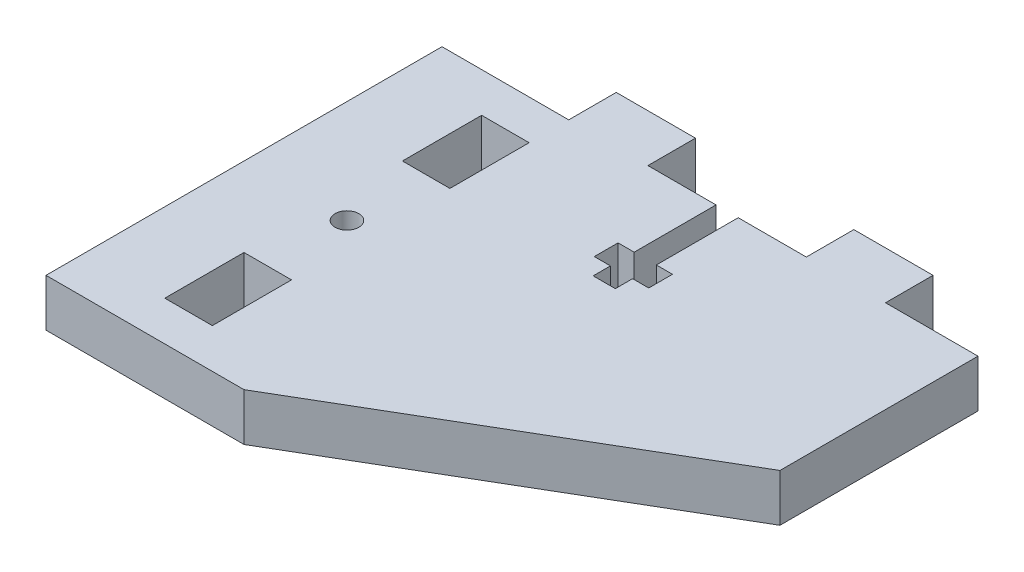
ISO-10303-21;
HEADER;
FILE_DESCRIPTION(('STEP AP214'),'2;1');
FILE_NAME('part.step','',(''),(''),'','','');
FILE_SCHEMA(('AUTOMOTIVE_DESIGN { 1 0 10303 214 1 1 1 1 }'));
ENDSEC;
DATA;
#1=APPLICATION_CONTEXT('core data for automotive mechanical design processes');
#2=APPLICATION_PROTOCOL_DEFINITION('international standard','automotive_design',2000,#1);
#3=PRODUCT_CONTEXT('',#1,'mechanical');
#4=PRODUCT('Part','Part','',(#3));
#5=PRODUCT_RELATED_PRODUCT_CATEGORY('part','',(#4));
#6=PRODUCT_DEFINITION_FORMATION('','',#4);
#7=PRODUCT_DEFINITION_CONTEXT('part definition',#1,'design');
#8=PRODUCT_DEFINITION('design','',#6,#7);
#9=PRODUCT_DEFINITION_SHAPE('','',#8);
#10=(LENGTH_UNIT() NAMED_UNIT(*) SI_UNIT(.MILLI.,.METRE.));
#11=(NAMED_UNIT(*) PLANE_ANGLE_UNIT() SI_UNIT($,.RADIAN.));
#12=(NAMED_UNIT(*) SI_UNIT($,.STERADIAN.) SOLID_ANGLE_UNIT());
#13=UNCERTAINTY_MEASURE_WITH_UNIT(LENGTH_MEASURE(1.E-05),#10,'distance_accuracy_value','');
#14=(GEOMETRIC_REPRESENTATION_CONTEXT(3) GLOBAL_UNCERTAINTY_ASSIGNED_CONTEXT((#13)) GLOBAL_UNIT_ASSIGNED_CONTEXT((#10,
#11,#12)) REPRESENTATION_CONTEXT('',''));
#15=CARTESIAN_POINT('',(0.,0.,0.));
#16=DIRECTION('',(0.,0.,1.));
#17=DIRECTION('',(1.,0.,0.));
#18=AXIS2_PLACEMENT_3D('',#15,#16,#17);
#19=CARTESIAN_POINT('',(0.,6.,0.));
#20=DIRECTION('',(0.,1.,0.));
#21=DIRECTION('',(0.,0.,1.));
#22=AXIS2_PLACEMENT_3D('',#19,#20,#21);
#23=PLANE('',#22);
#24=DIRECTION('',(0.,0.,-1.));
#25=VECTOR('',#24,1.);
#26=CARTESIAN_POINT('',(-3.41679338228182,6.,-32.7424237339418));
#27=LINE('',#26,#25);
#28=CARTESIAN_POINT('',(-3.41679338228182,6.,-32.7424237339418));
#29=VERTEX_POINT('',#28);
#30=CARTESIAN_POINT('',(-3.41679338228182,6.,-38.7424237339418));
#31=VERTEX_POINT('',#30);
#32=EDGE_CURVE('E323',#29,#31,#27,.T.);
#33=ORIENTED_EDGE('',*,*,#32,.T.);
#34=DIRECTION('',(-1.,0.,0.));
#35=VECTOR('',#34,1.);
#36=CARTESIAN_POINT('',(-3.41679338228182,6.,-38.7424237339418));
#37=LINE('',#36,#35);
#38=CARTESIAN_POINT('',(-13.4167933822818,6.,-38.7424237339418));
#39=VERTEX_POINT('',#38);
#40=EDGE_CURVE('E326',#31,#39,#37,.T.);
#41=ORIENTED_EDGE('',*,*,#40,.T.);
#42=DIRECTION('',(0.,0.,1.));
#43=VECTOR('',#42,1.);
#44=CARTESIAN_POINT('',(-13.4167933822818,6.,-38.7424237339418));
#45=LINE('',#44,#43);
#46=CARTESIAN_POINT('',(-13.4167933822818,6.,-32.7424237339418));
#47=VERTEX_POINT('',#46);
#48=EDGE_CURVE('E329',#39,#47,#45,.T.);
#49=ORIENTED_EDGE('',*,*,#48,.T.);
#50=DIRECTION('',(-1.,0.,0.));
#51=VECTOR('',#50,1.);
#52=CARTESIAN_POINT('',(-29.4167933822818,6.,-32.7424237339418));
#53=LINE('',#52,#51);
#54=CARTESIAN_POINT('',(-29.4167933822818,6.,-32.7424237339418));
#55=VERTEX_POINT('',#54);
#56=EDGE_CURVE('E331',#47,#55,#53,.T.);
#57=ORIENTED_EDGE('',*,*,#56,.T.);
#58=DIRECTION('',(0.,0.,1.));
#59=VECTOR('',#58,1.);
#60=CARTESIAN_POINT('',(-29.4167933822818,6.,17.2575762660582));
#61=LINE('',#60,#59);
#62=CARTESIAN_POINT('',(-29.4167933822818,6.,17.2575762660582));
#63=VERTEX_POINT('',#62);
#64=EDGE_CURVE('E333',#55,#63,#61,.T.);
#65=ORIENTED_EDGE('',*,*,#64,.T.);
#66=DIRECTION('',(1.,0.,0.));
#67=VECTOR('',#66,1.);
#68=CARTESIAN_POINT('',(-4.41679338228179,6.,17.2575762660582));
#69=LINE('',#68,#67);
#70=CARTESIAN_POINT('',(-4.41679338228179,6.,17.2575762660582));
#71=VERTEX_POINT('',#70);
#72=EDGE_CURVE('E335',#63,#71,#69,.T.);
#73=ORIENTED_EDGE('',*,*,#72,.T.);
#74=DIRECTION('',(0.862827066315105,0.,-0.50549921229817));
#75=VECTOR('',#74,1.);
#76=CARTESIAN_POINT('',(38.2552348486032,6.,-7.74242373394182));
#77=LINE('',#76,#75);
#78=CARTESIAN_POINT('',(38.2552348486032,6.,-7.74242373394182));
#79=VERTEX_POINT('',#78);
#80=EDGE_CURVE('E337',#71,#79,#77,.T.);
#81=ORIENTED_EDGE('',*,*,#80,.T.);
#82=DIRECTION('',(0.000167401965354733,0.,-0.999999985988291));
#83=VECTOR('',#82,1.);
#84=CARTESIAN_POINT('',(38.2594198977957,6.,-32.7424237339418));
#85=LINE('',#84,#83);
#86=CARTESIAN_POINT('',(38.2594198977957,6.,-32.7424237339418));
#87=VERTEX_POINT('',#86);
#88=EDGE_CURVE('E339',#79,#87,#85,.T.);
#89=ORIENTED_EDGE('',*,*,#88,.T.);
#90=DIRECTION('',(-1.,0.,0.));
#91=VECTOR('',#90,1.);
#92=CARTESIAN_POINT('',(26.5832066177182,6.,-32.7424237339418));
#93=LINE('',#92,#91);
#94=CARTESIAN_POINT('',(26.5832066177182,6.,-32.7424237339418));
#95=VERTEX_POINT('',#94);
#96=EDGE_CURVE('E341',#87,#95,#93,.T.);
#97=ORIENTED_EDGE('',*,*,#96,.T.);
#98=DIRECTION('',(0.,0.,-1.));
#99=VECTOR('',#98,1.);
#100=CARTESIAN_POINT('',(26.5832066177182,6.,-32.7424237339418));
#101=LINE('',#100,#99);
#102=CARTESIAN_POINT('',(26.5832066177182,6.,-38.7424237339418));
#103=VERTEX_POINT('',#102);
#104=EDGE_CURVE('E343',#95,#103,#101,.T.);
#105=ORIENTED_EDGE('',*,*,#104,.T.);
#106=DIRECTION('',(-1.,0.,0.));
#107=VECTOR('',#106,1.);
#108=CARTESIAN_POINT('',(26.5832066177182,6.,-38.7424237339418));
#109=LINE('',#108,#107);
#110=CARTESIAN_POINT('',(16.5832066177182,6.,-38.7424237339418));
#111=VERTEX_POINT('',#110);
#112=EDGE_CURVE('E345',#103,#111,#109,.T.);
#113=ORIENTED_EDGE('',*,*,#112,.T.);
#114=DIRECTION('',(0.,0.,1.));
#115=VECTOR('',#114,1.);
#116=CARTESIAN_POINT('',(16.5832066177182,6.,-38.7424237339418));
#117=LINE('',#116,#115);
#118=CARTESIAN_POINT('',(16.5832066177182,6.,-32.7424237339418));
#119=VERTEX_POINT('',#118);
#120=EDGE_CURVE('E347',#111,#119,#117,.T.);
#121=ORIENTED_EDGE('',*,*,#120,.T.);
#122=DIRECTION('',(-1.,0.,0.));
#123=VECTOR('',#122,1.);
#124=CARTESIAN_POINT('',(7.98320661771819,6.,-32.7424237339418));
#125=LINE('',#124,#123);
#126=CARTESIAN_POINT('',(7.98320661771819,6.,-32.7424237339418));
#127=VERTEX_POINT('',#126);
#128=EDGE_CURVE('E349',#119,#127,#125,.T.);
#129=ORIENTED_EDGE('',*,*,#128,.T.);
#130=DIRECTION('',(0.,0.,1.));
#131=VECTOR('',#130,1.);
#132=CARTESIAN_POINT('',(7.98320661771819,6.,-22.4070969902437));
#133=LINE('',#132,#131);
#134=CARTESIAN_POINT('',(7.98320661771819,6.,-22.4070969902437));
#135=VERTEX_POINT('',#134);
#136=EDGE_CURVE('E351',#127,#135,#133,.T.);
#137=ORIENTED_EDGE('',*,*,#136,.T.);
#138=DIRECTION('',(0.999999999706074,0.,2.42456429535602E-05));
#139=VECTOR('',#138,1.);
#140=CARTESIAN_POINT('',(10.0204108431038,6.,-22.4070475969174));
#141=LINE('',#140,#139);
#142=CARTESIAN_POINT('',(10.0204108431038,6.,-22.4070475969174));
#143=VERTEX_POINT('',#142);
#144=EDGE_CURVE('E353',#135,#143,#141,.T.);
#145=ORIENTED_EDGE('',*,*,#144,.T.);
#146=DIRECTION('',(-2.42456318967195E-05,0.,0.999999999706075));
#147=VECTOR('',#146,1.);
#148=CARTESIAN_POINT('',(10.0203381212962,6.,-19.4076699017507));
#149=LINE('',#148,#147);
#150=CARTESIAN_POINT('',(10.0203381212962,6.,-19.4076699017507));
#151=VERTEX_POINT('',#150);
#152=EDGE_CURVE('E355',#143,#151,#149,.T.);
#153=ORIENTED_EDGE('',*,*,#152,.T.);
#154=DIRECTION('',(-0.999999827572183,0.,0.000587244075526861));
#155=VECTOR('',#154,1.);
#156=CARTESIAN_POINT('',(7.98281563810904,6.,-19.4064733785374));
#157=LINE('',#156,#155);
#158=CARTESIAN_POINT('',(7.98281563810904,6.,-19.4064733785374));
#159=VERTEX_POINT('',#158);
#160=EDGE_CURVE('E357',#151,#159,#157,.T.);
#161=ORIENTED_EDGE('',*,*,#160,.T.);
#162=DIRECTION('',(0.000587244133306167,0.,0.999999827572149));
#163=VECTOR('',#162,1.);
#164=CARTESIAN_POINT('',(7.98409517526001,6.,-17.2275892351782));
#165=LINE('',#164,#163);
#166=CARTESIAN_POINT('',(7.98409517526001,6.,-17.2275892351782));
#167=VERTEX_POINT('',#166);
#168=EDGE_CURVE('E359',#159,#167,#165,.T.);
#169=ORIENTED_EDGE('',*,*,#168,.T.);
#170=DIRECTION('',(-0.999999827572136,0.,0.000587244154737405));
#171=VECTOR('',#170,1.);
#172=CARTESIAN_POINT('',(5.18409565805801,6.,-17.2259449515449));
#173=LINE('',#172,#171);
#174=CARTESIAN_POINT('',(5.18409565805801,6.,-17.2259449515449));
#175=VERTEX_POINT('',#174);
#176=EDGE_CURVE('E361',#167,#175,#173,.T.);
#177=ORIENTED_EDGE('',*,*,#176,.T.);
#178=DIRECTION('',(-0.000587244133306422,0.,-0.999999827572149));
#179=VECTOR('',#178,1.);
#180=CARTESIAN_POINT('',(5.18281439813076,6.,-19.4077627572173));
#181=LINE('',#180,#179);
#182=CARTESIAN_POINT('',(5.18281439813076,6.,-19.4077627572173));
#183=VERTEX_POINT('',#182);
#184=EDGE_CURVE('E363',#175,#183,#181,.T.);
#185=ORIENTED_EDGE('',*,*,#184,.T.);
#186=DIRECTION('',(-0.999999841516346,0.,0.000562998475983852));
#187=VECTOR('',#186,1.);
#188=CARTESIAN_POINT('',(3.14662387577407,6.,-19.4066163848748));
#189=LINE('',#188,#187);
#190=CARTESIAN_POINT('',(3.14662387577407,6.,-19.4066163848748));
#191=VERTEX_POINT('',#190);
#192=EDGE_CURVE('E365',#183,#191,#189,.T.);
#193=ORIENTED_EDGE('',*,*,#192,.T.);
#194=DIRECTION('',(2.42456429798376E-05,0.,-0.999999999706074));
#195=VECTOR('',#194,1.);
#196=CARTESIAN_POINT('',(3.14669662719877,6.,-22.4072142545381));
#197=LINE('',#196,#195);
#198=CARTESIAN_POINT('',(3.14669662719877,6.,-22.4072142545381));
#199=VERTEX_POINT('',#198);
#200=EDGE_CURVE('E367',#191,#199,#197,.T.);
#201=ORIENTED_EDGE('',*,*,#200,.T.);
#202=DIRECTION('',(0.999999999706074,0.,2.42456429516709E-05));
#203=VECTOR('',#202,1.);
#204=CARTESIAN_POINT('',(5.18320661771819,6.,-22.407164878044));
#205=LINE('',#204,#203);
#206=CARTESIAN_POINT('',(5.18320661771819,6.,-22.407164878044));
#207=VERTEX_POINT('',#206);
#208=EDGE_CURVE('E369',#199,#207,#205,.T.);
#209=ORIENTED_EDGE('',*,*,#208,.T.);
#210=DIRECTION('',(0.,0.,-1.));
#211=VECTOR('',#210,1.);
#212=CARTESIAN_POINT('',(5.18320661771819,6.,-32.7424237339418));
#213=LINE('',#212,#211);
#214=CARTESIAN_POINT('',(5.18320661771819,6.,-32.7424237339418));
#215=VERTEX_POINT('',#214);
#216=EDGE_CURVE('E371',#207,#215,#213,.T.);
#217=ORIENTED_EDGE('',*,*,#216,.T.);
#218=DIRECTION('',(-1.,0.,0.));
#219=VECTOR('',#218,1.);
#220=CARTESIAN_POINT('',(-3.41679338228182,6.,-32.7424237339418));
#221=LINE('',#220,#219);
#222=EDGE_CURVE('E373',#215,#29,#221,.T.);
#223=ORIENTED_EDGE('',*,*,#222,.T.);
#224=EDGE_LOOP('',(#33,#41,#49,#57,#65,#73,#81,#89,#97,#105,#113,#121,#129,#137,#145,#153,#161,
#169,#177,#185,#193,#201,#209,#217,#223));
#225=FACE_BOUND('',#224,.T.);
#226=CARTESIAN_POINT('',(-16.4167933822818,6.,-7.74242373394182));
#227=DIRECTION('',(0.,1.,0.));
#228=DIRECTION('',(0.,0.,1.));
#229=AXIS2_PLACEMENT_3D('',#226,#227,#228);
#230=CIRCLE('',#229,1.49999999999999);
#231=CARTESIAN_POINT('',(-16.4167933822818,6.,-6.24242373394183));
#232=VERTEX_POINT('',#231);
#233=EDGE_CURVE('E317',#232,#232,#230,.T.);
#234=ORIENTED_EDGE('',*,*,#233,.F.);
#235=EDGE_LOOP('',(#234));
#236=FACE_BOUND('',#235,.T.);
#237=DIRECTION('',(-1.,0.,0.));
#238=VECTOR('',#237,1.);
#239=CARTESIAN_POINT('',(-13.4167933822818,6.,-27.7424237339418));
#240=LINE('',#239,#238);
#241=CARTESIAN_POINT('',(-13.4167933822818,6.,-27.7424237339418));
#242=VERTEX_POINT('',#241);
#243=CARTESIAN_POINT('',(-19.4167933822818,6.,-27.7424237339418));
#244=VERTEX_POINT('',#243);
#245=EDGE_CURVE('E288',#242,#244,#240,.T.);
#246=ORIENTED_EDGE('',*,*,#245,.F.);
#247=DIRECTION('',(0.,0.,-1.));
#248=VECTOR('',#247,1.);
#249=CARTESIAN_POINT('',(-13.4167933822818,6.,-17.7424237339418));
#250=LINE('',#249,#248);
#251=CARTESIAN_POINT('',(-13.4167933822818,6.,-17.7424237339418));
#252=VERTEX_POINT('',#251);
#253=EDGE_CURVE('E286',#252,#242,#250,.T.);
#254=ORIENTED_EDGE('',*,*,#253,.F.);
#255=DIRECTION('',(1.,0.,0.));
#256=VECTOR('',#255,1.);
#257=CARTESIAN_POINT('',(-19.4167933822818,6.,-17.7424237339418));
#258=LINE('',#257,#256);
#259=CARTESIAN_POINT('',(-19.4167933822818,6.,-17.7424237339418));
#260=VERTEX_POINT('',#259);
#261=EDGE_CURVE('E294',#260,#252,#258,.T.);
#262=ORIENTED_EDGE('',*,*,#261,.F.);
#263=DIRECTION('',(0.,0.,1.));
#264=VECTOR('',#263,1.);
#265=CARTESIAN_POINT('',(-19.4167933822818,6.,-27.7424237339418));
#266=LINE('',#265,#264);
#267=EDGE_CURVE('E291',#244,#260,#266,.T.);
#268=ORIENTED_EDGE('',*,*,#267,.F.);
#269=EDGE_LOOP('',(#246,#254,#262,#268));
#270=FACE_BOUND('',#269,.T.);
#271=DIRECTION('',(0.,0.,-1.));
#272=VECTOR('',#271,1.);
#273=CARTESIAN_POINT('',(-13.4167933822818,6.,12.2575762660582));
#274=LINE('',#273,#272);
#275=CARTESIAN_POINT('',(-13.4167933822818,6.,12.2575762660582));
#276=VERTEX_POINT('',#275);
#277=CARTESIAN_POINT('',(-13.4167933822818,6.,2.25757626605818));
#278=VERTEX_POINT('',#277);
#279=EDGE_CURVE('E258',#276,#278,#274,.T.);
#280=ORIENTED_EDGE('',*,*,#279,.F.);
#281=DIRECTION('',(1.,0.,0.));
#282=VECTOR('',#281,1.);
#283=CARTESIAN_POINT('',(-19.4167933822818,6.,12.2575762660582));
#284=LINE('',#283,#282);
#285=CARTESIAN_POINT('',(-19.4167933822818,6.,12.2575762660582));
#286=VERTEX_POINT('',#285);
#287=EDGE_CURVE('E250',#286,#276,#284,.T.);
#288=ORIENTED_EDGE('',*,*,#287,.F.);
#289=DIRECTION('',(0.,0.,1.));
#290=VECTOR('',#289,1.);
#291=CARTESIAN_POINT('',(-19.4167933822818,6.,2.25757626605818));
#292=LINE('',#291,#290);
#293=CARTESIAN_POINT('',(-19.4167933822818,6.,2.25757626605818));
#294=VERTEX_POINT('',#293);
#295=EDGE_CURVE('E272',#294,#286,#292,.T.);
#296=ORIENTED_EDGE('',*,*,#295,.F.);
#297=DIRECTION('',(-1.,0.,0.));
#298=VECTOR('',#297,1.);
#299=CARTESIAN_POINT('',(-13.4167933822818,6.,2.25757626605818));
#300=LINE('',#299,#298);
#301=EDGE_CURVE('E270',#278,#294,#300,.T.);
#302=ORIENTED_EDGE('',*,*,#301,.F.);
#303=EDGE_LOOP('',(#280,#288,#296,#302));
#304=FACE_BOUND('',#303,.T.);
#305=ADVANCED_FACE('F35',(#225,#236,#270,#304),#23,.T.);
#306=CARTESIAN_POINT('',(0.,0.,0.));
#307=DIRECTION('',(0.,1.,0.));
#308=DIRECTION('',(0.,0.,1.));
#309=AXIS2_PLACEMENT_3D('',#306,#307,#308);
#310=PLANE('',#309);
#311=DIRECTION('',(0.,0.,-1.));
#312=VECTOR('',#311,1.);
#313=CARTESIAN_POINT('',(-13.4167933822818,0.,-17.7424237339418));
#314=LINE('',#313,#312);
#315=CARTESIAN_POINT('',(-13.4167933822818,0.,-17.7424237339418));
#316=VERTEX_POINT('',#315);
#317=CARTESIAN_POINT('',(-13.4167933822818,0.,-27.7424237339418));
#318=VERTEX_POINT('',#317);
#319=EDGE_CURVE('E266',#316,#318,#314,.T.);
#320=ORIENTED_EDGE('',*,*,#319,.T.);
#321=DIRECTION('',(-1.,0.,0.));
#322=VECTOR('',#321,1.);
#323=CARTESIAN_POINT('',(-13.4167933822818,0.,-27.7424237339418));
#324=LINE('',#323,#322);
#325=CARTESIAN_POINT('',(-19.4167933822818,0.,-27.7424237339418));
#326=VERTEX_POINT('',#325);
#327=EDGE_CURVE('E299',#318,#326,#324,.T.);
#328=ORIENTED_EDGE('',*,*,#327,.T.);
#329=DIRECTION('',(0.,0.,1.));
#330=VECTOR('',#329,1.);
#331=CARTESIAN_POINT('',(-19.4167933822818,0.,-27.7424237339418));
#332=LINE('',#331,#330);
#333=CARTESIAN_POINT('',(-19.4167933822818,0.,-17.7424237339418));
#334=VERTEX_POINT('',#333);
#335=EDGE_CURVE('E302',#326,#334,#332,.T.);
#336=ORIENTED_EDGE('',*,*,#335,.T.);
#337=DIRECTION('',(1.,0.,0.));
#338=VECTOR('',#337,1.);
#339=CARTESIAN_POINT('',(-19.4167933822818,0.,-17.7424237339418));
#340=LINE('',#339,#338);
#341=EDGE_CURVE('E289',#334,#316,#340,.T.);
#342=ORIENTED_EDGE('',*,*,#341,.T.);
#343=EDGE_LOOP('',(#320,#328,#336,#342));
#344=FACE_BOUND('',#343,.T.);
#345=DIRECTION('',(0.,0.,-1.));
#346=VECTOR('',#345,1.);
#347=CARTESIAN_POINT('',(-3.41679338228182,0.,-32.7424237339418));
#348=LINE('',#347,#346);
#349=CARTESIAN_POINT('',(-3.41679338228182,0.,-32.7424237339418));
#350=VERTEX_POINT('',#349);
#351=CARTESIAN_POINT('',(-3.41679338228182,0.,-38.7424237339418));
#352=VERTEX_POINT('',#351);
#353=EDGE_CURVE('E320',#350,#352,#348,.T.);
#354=ORIENTED_EDGE('',*,*,#353,.F.);
#355=DIRECTION('',(-1.,0.,0.));
#356=VECTOR('',#355,1.);
#357=CARTESIAN_POINT('',(-3.41679338228182,0.,-32.7424237339418));
#358=LINE('',#357,#356);
#359=CARTESIAN_POINT('',(5.18320661771819,0.,-32.7424237339418));
#360=VERTEX_POINT('',#359);
#361=EDGE_CURVE('E327',#360,#350,#358,.T.);
#362=ORIENTED_EDGE('',*,*,#361,.F.);
#363=DIRECTION('',(0.,0.,-1.));
#364=VECTOR('',#363,1.);
#365=CARTESIAN_POINT('',(5.18320661771819,0.,-32.7424237339418));
#366=LINE('',#365,#364);
#367=CARTESIAN_POINT('',(5.18320661771819,0.,-22.407164878044));
#368=VERTEX_POINT('',#367);
#369=EDGE_CURVE('E422',#368,#360,#366,.T.);
#370=ORIENTED_EDGE('',*,*,#369,.F.);
#371=DIRECTION('',(0.999999999706074,0.,2.42456429516709E-05));
#372=VECTOR('',#371,1.);
#373=CARTESIAN_POINT('',(5.18320661771819,0.,-22.407164878044));
#374=LINE('',#373,#372);
#375=CARTESIAN_POINT('',(3.14669662719877,0.,-22.4072142545381));
#376=VERTEX_POINT('',#375);
#377=EDGE_CURVE('E420',#376,#368,#374,.T.);
#378=ORIENTED_EDGE('',*,*,#377,.F.);
#379=DIRECTION('',(2.42456429798376E-05,0.,-0.999999999706074));
#380=VECTOR('',#379,1.);
#381=CARTESIAN_POINT('',(3.14669662719877,0.,-22.4072142545381));
#382=LINE('',#381,#380);
#383=CARTESIAN_POINT('',(3.14662387577407,0.,-19.4066163848748));
#384=VERTEX_POINT('',#383);
#385=EDGE_CURVE('E418',#384,#376,#382,.T.);
#386=ORIENTED_EDGE('',*,*,#385,.F.);
#387=DIRECTION('',(-0.999999841516346,0.,0.000562998475983852));
#388=VECTOR('',#387,1.);
#389=CARTESIAN_POINT('',(3.14662387577407,0.,-19.4066163848748));
#390=LINE('',#389,#388);
#391=CARTESIAN_POINT('',(5.18281439813076,0.,-19.4077627572173));
#392=VERTEX_POINT('',#391);
#393=EDGE_CURVE('E416',#392,#384,#390,.T.);
#394=ORIENTED_EDGE('',*,*,#393,.F.);
#395=DIRECTION('',(-0.000587244133306422,0.,-0.999999827572149));
#396=VECTOR('',#395,1.);
#397=CARTESIAN_POINT('',(5.18281439813076,0.,-19.4077627572173));
#398=LINE('',#397,#396);
#399=CARTESIAN_POINT('',(5.18409565805801,0.,-17.2259449515449));
#400=VERTEX_POINT('',#399);
#401=EDGE_CURVE('E414',#400,#392,#398,.T.);
#402=ORIENTED_EDGE('',*,*,#401,.F.);
#403=DIRECTION('',(-0.999999827572136,0.,0.000587244154737405));
#404=VECTOR('',#403,1.);
#405=CARTESIAN_POINT('',(5.18409565805801,0.,-17.2259449515449));
#406=LINE('',#405,#404);
#407=CARTESIAN_POINT('',(7.98409517526001,0.,-17.2275892351782));
#408=VERTEX_POINT('',#407);
#409=EDGE_CURVE('E412',#408,#400,#406,.T.);
#410=ORIENTED_EDGE('',*,*,#409,.F.);
#411=DIRECTION('',(0.000587244133306167,0.,0.999999827572149));
#412=VECTOR('',#411,1.);
#413=CARTESIAN_POINT('',(7.98409517526001,0.,-17.2275892351782));
#414=LINE('',#413,#412);
#415=CARTESIAN_POINT('',(7.98281563810904,0.,-19.4064733785374));
#416=VERTEX_POINT('',#415);
#417=EDGE_CURVE('E410',#416,#408,#414,.T.);
#418=ORIENTED_EDGE('',*,*,#417,.F.);
#419=DIRECTION('',(-0.999999827572183,0.,0.000587244075526861));
#420=VECTOR('',#419,1.);
#421=CARTESIAN_POINT('',(7.98281563810904,0.,-19.4064733785374));
#422=LINE('',#421,#420);
#423=CARTESIAN_POINT('',(10.0203381212962,0.,-19.4076699017507));
#424=VERTEX_POINT('',#423);
#425=EDGE_CURVE('E408',#424,#416,#422,.T.);
#426=ORIENTED_EDGE('',*,*,#425,.F.);
#427=DIRECTION('',(-2.42456318967195E-05,0.,0.999999999706075));
#428=VECTOR('',#427,1.);
#429=CARTESIAN_POINT('',(10.0203381212962,0.,-19.4076699017507));
#430=LINE('',#429,#428);
#431=CARTESIAN_POINT('',(10.0204108431038,0.,-22.4070475969174));
#432=VERTEX_POINT('',#431);
#433=EDGE_CURVE('E406',#432,#424,#430,.T.);
#434=ORIENTED_EDGE('',*,*,#433,.F.);
#435=DIRECTION('',(0.999999999706074,0.,2.42456429535602E-05));
#436=VECTOR('',#435,1.);
#437=CARTESIAN_POINT('',(10.0204108431038,0.,-22.4070475969174));
#438=LINE('',#437,#436);
#439=CARTESIAN_POINT('',(7.98320661771819,0.,-22.4070969902437));
#440=VERTEX_POINT('',#439);
#441=EDGE_CURVE('E404',#440,#432,#438,.T.);
#442=ORIENTED_EDGE('',*,*,#441,.F.);
#443=DIRECTION('',(0.,0.,1.));
#444=VECTOR('',#443,1.);
#445=CARTESIAN_POINT('',(7.98320661771819,0.,-22.4070969902437));
#446=LINE('',#445,#444);
#447=CARTESIAN_POINT('',(7.98320661771819,0.,-32.7424237339418));
#448=VERTEX_POINT('',#447);
#449=EDGE_CURVE('E402',#448,#440,#446,.T.);
#450=ORIENTED_EDGE('',*,*,#449,.F.);
#451=DIRECTION('',(-1.,0.,0.));
#452=VECTOR('',#451,1.);
#453=CARTESIAN_POINT('',(7.98320661771819,0.,-32.7424237339418));
#454=LINE('',#453,#452);
#455=CARTESIAN_POINT('',(16.5832066177182,0.,-32.7424237339418));
#456=VERTEX_POINT('',#455);
#457=EDGE_CURVE('E400',#456,#448,#454,.T.);
#458=ORIENTED_EDGE('',*,*,#457,.F.);
#459=DIRECTION('',(0.,0.,1.));
#460=VECTOR('',#459,1.);
#461=CARTESIAN_POINT('',(16.5832066177182,0.,-38.7424237339418));
#462=LINE('',#461,#460);
#463=CARTESIAN_POINT('',(16.5832066177182,0.,-38.7424237339418));
#464=VERTEX_POINT('',#463);
#465=EDGE_CURVE('E398',#464,#456,#462,.T.);
#466=ORIENTED_EDGE('',*,*,#465,.F.);
#467=DIRECTION('',(-1.,0.,0.));
#468=VECTOR('',#467,1.);
#469=CARTESIAN_POINT('',(26.5832066177182,0.,-38.7424237339418));
#470=LINE('',#469,#468);
#471=CARTESIAN_POINT('',(26.5832066177182,0.,-38.7424237339418));
#472=VERTEX_POINT('',#471);
#473=EDGE_CURVE('E396',#472,#464,#470,.T.);
#474=ORIENTED_EDGE('',*,*,#473,.F.);
#475=DIRECTION('',(0.,0.,-1.));
#476=VECTOR('',#475,1.);
#477=CARTESIAN_POINT('',(26.5832066177182,0.,-32.7424237339418));
#478=LINE('',#477,#476);
#479=CARTESIAN_POINT('',(26.5832066177182,0.,-32.7424237339418));
#480=VERTEX_POINT('',#479);
#481=EDGE_CURVE('E394',#480,#472,#478,.T.);
#482=ORIENTED_EDGE('',*,*,#481,.F.);
#483=DIRECTION('',(-1.,0.,0.));
#484=VECTOR('',#483,1.);
#485=CARTESIAN_POINT('',(26.5832066177182,0.,-32.7424237339418));
#486=LINE('',#485,#484);
#487=CARTESIAN_POINT('',(38.2594198977957,0.,-32.7424237339418));
#488=VERTEX_POINT('',#487);
#489=EDGE_CURVE('E392',#488,#480,#486,.T.);
#490=ORIENTED_EDGE('',*,*,#489,.F.);
#491=DIRECTION('',(0.000167401965354733,0.,-0.999999985988291));
#492=VECTOR('',#491,1.);
#493=CARTESIAN_POINT('',(38.2594198977957,0.,-32.7424237339418));
#494=LINE('',#493,#492);
#495=CARTESIAN_POINT('',(38.2552348486032,0.,-7.74242373394182));
#496=VERTEX_POINT('',#495);
#497=EDGE_CURVE('E390',#496,#488,#494,.T.);
#498=ORIENTED_EDGE('',*,*,#497,.F.);
#499=DIRECTION('',(0.862827066315105,0.,-0.50549921229817));
#500=VECTOR('',#499,1.);
#501=CARTESIAN_POINT('',(38.2552348486032,0.,-7.74242373394182));
#502=LINE('',#501,#500);
#503=CARTESIAN_POINT('',(-4.41679338228179,0.,17.2575762660582));
#504=VERTEX_POINT('',#503);
#505=EDGE_CURVE('E388',#504,#496,#502,.T.);
#506=ORIENTED_EDGE('',*,*,#505,.F.);
#507=DIRECTION('',(1.,0.,0.));
#508=VECTOR('',#507,1.);
#509=CARTESIAN_POINT('',(-4.41679338228179,0.,17.2575762660582));
#510=LINE('',#509,#508);
#511=CARTESIAN_POINT('',(-29.4167933822818,0.,17.2575762660582));
#512=VERTEX_POINT('',#511);
#513=EDGE_CURVE('E386',#512,#504,#510,.T.);
#514=ORIENTED_EDGE('',*,*,#513,.F.);
#515=DIRECTION('',(0.,0.,1.));
#516=VECTOR('',#515,1.);
#517=CARTESIAN_POINT('',(-29.4167933822818,0.,17.2575762660582));
#518=LINE('',#517,#516);
#519=CARTESIAN_POINT('',(-29.4167933822818,0.,-32.7424237339418));
#520=VERTEX_POINT('',#519);
#521=EDGE_CURVE('E384',#520,#512,#518,.T.);
#522=ORIENTED_EDGE('',*,*,#521,.F.);
#523=DIRECTION('',(-1.,0.,0.));
#524=VECTOR('',#523,1.);
#525=CARTESIAN_POINT('',(-29.4167933822818,0.,-32.7424237339418));
#526=LINE('',#525,#524);
#527=CARTESIAN_POINT('',(-13.4167933822818,0.,-32.7424237339418));
#528=VERTEX_POINT('',#527);
#529=EDGE_CURVE('E382',#528,#520,#526,.T.);
#530=ORIENTED_EDGE('',*,*,#529,.F.);
#531=DIRECTION('',(0.,0.,1.));
#532=VECTOR('',#531,1.);
#533=CARTESIAN_POINT('',(-13.4167933822818,0.,-38.7424237339418));
#534=LINE('',#533,#532);
#535=CARTESIAN_POINT('',(-13.4167933822818,0.,-38.7424237339418));
#536=VERTEX_POINT('',#535);
#537=EDGE_CURVE('E380',#536,#528,#534,.T.);
#538=ORIENTED_EDGE('',*,*,#537,.F.);
#539=DIRECTION('',(-1.,0.,0.));
#540=VECTOR('',#539,1.);
#541=CARTESIAN_POINT('',(-3.41679338228182,0.,-38.7424237339418));
#542=LINE('',#541,#540);
#543=EDGE_CURVE('E378',#352,#536,#542,.T.);
#544=ORIENTED_EDGE('',*,*,#543,.F.);
#545=EDGE_LOOP('',(#354,#362,#370,#378,#386,#394,#402,#410,#418,#426,#434,#442,#450,#458,#466,
#474,#482,#490,#498,#506,#514,#522,#530,#538,#544));
#546=FACE_BOUND('',#545,.T.);
#547=CARTESIAN_POINT('',(-16.4167933822818,0.,-7.74242373394182));
#548=DIRECTION('',(0.,1.,0.));
#549=DIRECTION('',(0.,0.,1.));
#550=AXIS2_PLACEMENT_3D('',#547,#548,#549);
#551=CIRCLE('',#550,1.49999999999999);
#552=CARTESIAN_POINT('',(-16.4167933822818,0.,-6.24242373394183));
#553=VERTEX_POINT('',#552);
#554=EDGE_CURVE('E316',#553,#553,#551,.T.);
#555=ORIENTED_EDGE('',*,*,#554,.T.);
#556=EDGE_LOOP('',(#555));
#557=FACE_BOUND('',#556,.T.);
#558=DIRECTION('',(1.,0.,0.));
#559=VECTOR('',#558,1.);
#560=CARTESIAN_POINT('',(-19.4167933822818,0.,12.2575762660582));
#561=LINE('',#560,#559);
#562=CARTESIAN_POINT('',(-19.4167933822818,0.,12.2575762660582));
#563=VERTEX_POINT('',#562);
#564=CARTESIAN_POINT('',(-13.4167933822818,0.,12.2575762660582));
#565=VERTEX_POINT('',#564);
#566=EDGE_CURVE('E58',#563,#565,#561,.T.);
#567=ORIENTED_EDGE('',*,*,#566,.T.);
#568=DIRECTION('',(0.,0.,-1.));
#569=VECTOR('',#568,1.);
#570=CARTESIAN_POINT('',(-13.4167933822818,0.,12.2575762660582));
#571=LINE('',#570,#569);
#572=CARTESIAN_POINT('',(-13.4167933822818,0.,2.25757626605818));
#573=VERTEX_POINT('',#572);
#574=EDGE_CURVE('E265',#565,#573,#571,.T.);
#575=ORIENTED_EDGE('',*,*,#574,.T.);
#576=DIRECTION('',(-1.,0.,0.));
#577=VECTOR('',#576,1.);
#578=CARTESIAN_POINT('',(-13.4167933822818,0.,2.25757626605818));
#579=LINE('',#578,#577);
#580=CARTESIAN_POINT('',(-19.4167933822818,0.,2.25757626605818));
#581=VERTEX_POINT('',#580);
#582=EDGE_CURVE('E278',#573,#581,#579,.T.);
#583=ORIENTED_EDGE('',*,*,#582,.T.);
#584=DIRECTION('',(0.,0.,1.));
#585=VECTOR('',#584,1.);
#586=CARTESIAN_POINT('',(-19.4167933822818,0.,2.25757626605818));
#587=LINE('',#586,#585);
#588=EDGE_CURVE('E259',#581,#563,#587,.T.);
#589=ORIENTED_EDGE('',*,*,#588,.T.);
#590=EDGE_LOOP('',(#567,#575,#583,#589));
#591=FACE_BOUND('',#590,.T.);
#592=ADVANCED_FACE('F503',(#344,#546,#557,#591),#310,.F.);
#593=CARTESIAN_POINT('',(-3.41679338228182,6.,-32.7424237339418));
#594=DIRECTION('',(-1.,0.,0.));
#595=DIRECTION('',(0.,0.,1.));
#596=AXIS2_PLACEMENT_3D('',#593,#594,#595);
#597=PLANE('',#596);
#598=ORIENTED_EDGE('',*,*,#353,.T.);
#599=DIRECTION('',(0.,-1.,0.));
#600=VECTOR('',#599,1.);
#601=CARTESIAN_POINT('',(-3.41679338228182,6.,-38.7424237339418));
#602=LINE('',#601,#600);
#603=EDGE_CURVE('E11',#31,#352,#602,.T.);
#604=ORIENTED_EDGE('',*,*,#603,.F.);
#605=ORIENTED_EDGE('',*,*,#32,.F.);
#606=DIRECTION('',(0.,-1.,0.));
#607=VECTOR('',#606,1.);
#608=CARTESIAN_POINT('',(-3.41679338228182,6.,-32.7424237339418));
#609=LINE('',#608,#607);
#610=EDGE_CURVE('E375',#29,#350,#609,.T.);
#611=ORIENTED_EDGE('',*,*,#610,.T.);
#612=EDGE_LOOP('',(#598,#604,#605,#611));
#613=FACE_BOUND('',#612,.T.);
#614=ADVANCED_FACE('F37',(#613),#597,.F.);
#615=CARTESIAN_POINT('',(-3.41679338228182,6.,-38.7424237339418));
#616=DIRECTION('',(0.,0.,1.));
#617=DIRECTION('',(1.,0.,0.));
#618=AXIS2_PLACEMENT_3D('',#615,#616,#617);
#619=PLANE('',#618);
#620=ORIENTED_EDGE('',*,*,#543,.T.);
#621=DIRECTION('',(0.,-1.,0.));
#622=VECTOR('',#621,1.);
#623=CARTESIAN_POINT('',(-13.4167933822818,6.,-38.7424237339418));
#624=LINE('',#623,#622);
#625=EDGE_CURVE('E43',#39,#536,#624,.T.);
#626=ORIENTED_EDGE('',*,*,#625,.F.);
#627=ORIENTED_EDGE('',*,*,#40,.F.);
#628=ORIENTED_EDGE('',*,*,#603,.T.);
#629=EDGE_LOOP('',(#620,#626,#627,#628));
#630=FACE_BOUND('',#629,.T.);
#631=ADVANCED_FACE('F521',(#630),#619,.F.);
#632=CARTESIAN_POINT('',(-13.4167933822818,6.,-38.7424237339418));
#633=DIRECTION('',(1.,0.,0.));
#634=DIRECTION('',(0.,0.,-1.));
#635=AXIS2_PLACEMENT_3D('',#632,#633,#634);
#636=PLANE('',#635);
#637=ORIENTED_EDGE('',*,*,#537,.T.);
#638=DIRECTION('',(0.,-1.,0.));
#639=VECTOR('',#638,1.);
#640=CARTESIAN_POINT('',(-13.4167933822818,6.,-32.7424237339418));
#641=LINE('',#640,#639);
#642=EDGE_CURVE('E490',#47,#528,#641,.T.);
#643=ORIENTED_EDGE('',*,*,#642,.F.);
#644=ORIENTED_EDGE('',*,*,#48,.F.);
#645=ORIENTED_EDGE('',*,*,#625,.T.);
#646=EDGE_LOOP('',(#637,#643,#644,#645));
#647=FACE_BOUND('',#646,.T.);
#648=ADVANCED_FACE('F497',(#647),#636,.F.);
#649=CARTESIAN_POINT('',(-29.4167933822818,6.,-32.7424237339418));
#650=DIRECTION('',(0.,0.,1.));
#651=DIRECTION('',(1.,0.,0.));
#652=AXIS2_PLACEMENT_3D('',#649,#650,#651);
#653=PLANE('',#652);
#654=ORIENTED_EDGE('',*,*,#529,.T.);
#655=DIRECTION('',(0.,-1.,0.));
#656=VECTOR('',#655,1.);
#657=CARTESIAN_POINT('',(-29.4167933822818,6.,-32.7424237339418));
#658=LINE('',#657,#656);
#659=EDGE_CURVE('E487',#55,#520,#658,.T.);
#660=ORIENTED_EDGE('',*,*,#659,.F.);
#661=ORIENTED_EDGE('',*,*,#56,.F.);
#662=ORIENTED_EDGE('',*,*,#642,.T.);
#663=EDGE_LOOP('',(#654,#660,#661,#662));
#664=FACE_BOUND('',#663,.T.);
#665=ADVANCED_FACE('F509',(#664),#653,.F.);
#666=CARTESIAN_POINT('',(-29.4167933822818,6.,17.2575762660582));
#667=DIRECTION('',(1.,0.,0.));
#668=DIRECTION('',(0.,0.,-1.));
#669=AXIS2_PLACEMENT_3D('',#666,#667,#668);
#670=PLANE('',#669);
#671=ORIENTED_EDGE('',*,*,#521,.T.);
#672=DIRECTION('',(0.,-1.,0.));
#673=VECTOR('',#672,1.);
#674=CARTESIAN_POINT('',(-29.4167933822818,6.,17.2575762660582));
#675=LINE('',#674,#673);
#676=EDGE_CURVE('E484',#63,#512,#675,.T.);
#677=ORIENTED_EDGE('',*,*,#676,.F.);
#678=ORIENTED_EDGE('',*,*,#64,.F.);
#679=ORIENTED_EDGE('',*,*,#659,.T.);
#680=EDGE_LOOP('',(#671,#677,#678,#679));
#681=FACE_BOUND('',#680,.T.);
#682=ADVANCED_FACE('F513',(#681),#670,.F.);
#683=CARTESIAN_POINT('',(-4.41679338228179,6.,17.2575762660582));
#684=DIRECTION('',(0.,0.,-1.));
#685=DIRECTION('',(-1.,0.,0.));
#686=AXIS2_PLACEMENT_3D('',#683,#684,#685);
#687=PLANE('',#686);
#688=ORIENTED_EDGE('',*,*,#513,.T.);
#689=DIRECTION('',(0.,-1.,0.));
#690=VECTOR('',#689,1.);
#691=CARTESIAN_POINT('',(-4.41679338228179,6.,17.2575762660582));
#692=LINE('',#691,#690);
#693=EDGE_CURVE('E481',#71,#504,#692,.T.);
#694=ORIENTED_EDGE('',*,*,#693,.F.);
#695=ORIENTED_EDGE('',*,*,#72,.F.);
#696=ORIENTED_EDGE('',*,*,#676,.T.);
#697=EDGE_LOOP('',(#688,#694,#695,#696));
#698=FACE_BOUND('',#697,.T.);
#699=ADVANCED_FACE('F619',(#698),#687,.F.);
#700=CARTESIAN_POINT('',(38.2552348486032,6.,-7.74242373394182));
#701=DIRECTION('',(-0.50549921229817,0.,-0.862827066315104));
#702=DIRECTION('',(-0.862827066315105,0.,0.50549921229817));
#703=AXIS2_PLACEMENT_3D('',#700,#701,#702);
#704=PLANE('',#703);
#705=ORIENTED_EDGE('',*,*,#505,.T.);
#706=DIRECTION('',(0.,-1.,0.));
#707=VECTOR('',#706,1.);
#708=CARTESIAN_POINT('',(38.2552348486032,6.,-7.74242373394182));
#709=LINE('',#708,#707);
#710=EDGE_CURVE('E478',#79,#496,#709,.T.);
#711=ORIENTED_EDGE('',*,*,#710,.F.);
#712=ORIENTED_EDGE('',*,*,#80,.F.);
#713=ORIENTED_EDGE('',*,*,#693,.T.);
#714=EDGE_LOOP('',(#705,#711,#712,#713));
#715=FACE_BOUND('',#714,.T.);
#716=ADVANCED_FACE('F616',(#715),#704,.F.);
#717=CARTESIAN_POINT('',(38.2594198977957,6.,-32.7424237339418));
#718=DIRECTION('',(-0.999999985988291,0.,-0.000167401965354733));
#719=DIRECTION('',(-0.000167401965354733,0.,0.999999985988291));
#720=AXIS2_PLACEMENT_3D('',#717,#718,#719);
#721=PLANE('',#720);
#722=ORIENTED_EDGE('',*,*,#497,.T.);
#723=DIRECTION('',(0.,-1.,0.));
#724=VECTOR('',#723,1.);
#725=CARTESIAN_POINT('',(38.2594198977957,6.,-32.7424237339418));
#726=LINE('',#725,#724);
#727=EDGE_CURVE('E475',#87,#488,#726,.T.);
#728=ORIENTED_EDGE('',*,*,#727,.F.);
#729=ORIENTED_EDGE('',*,*,#88,.F.);
#730=ORIENTED_EDGE('',*,*,#710,.T.);
#731=EDGE_LOOP('',(#722,#728,#729,#730));
#732=FACE_BOUND('',#731,.T.);
#733=ADVANCED_FACE('F612',(#732),#721,.F.);
#734=CARTESIAN_POINT('',(26.5832066177182,6.,-32.7424237339418));
#735=DIRECTION('',(0.,0.,1.));
#736=DIRECTION('',(1.,0.,0.));
#737=AXIS2_PLACEMENT_3D('',#734,#735,#736);
#738=PLANE('',#737);
#739=ORIENTED_EDGE('',*,*,#489,.T.);
#740=DIRECTION('',(0.,-1.,0.));
#741=VECTOR('',#740,1.);
#742=CARTESIAN_POINT('',(26.5832066177182,6.,-32.7424237339418));
#743=LINE('',#742,#741);
#744=EDGE_CURVE('E472',#95,#480,#743,.T.);
#745=ORIENTED_EDGE('',*,*,#744,.F.);
#746=ORIENTED_EDGE('',*,*,#96,.F.);
#747=ORIENTED_EDGE('',*,*,#727,.T.);
#748=EDGE_LOOP('',(#739,#745,#746,#747));
#749=FACE_BOUND('',#748,.T.);
#750=ADVANCED_FACE('F608',(#749),#738,.F.);
#751=CARTESIAN_POINT('',(26.5832066177182,6.,-32.7424237339418));
#752=DIRECTION('',(-1.,0.,0.));
#753=DIRECTION('',(0.,0.,1.));
#754=AXIS2_PLACEMENT_3D('',#751,#752,#753);
#755=PLANE('',#754);
#756=ORIENTED_EDGE('',*,*,#481,.T.);
#757=DIRECTION('',(0.,-1.,0.));
#758=VECTOR('',#757,1.);
#759=CARTESIAN_POINT('',(26.5832066177182,6.,-38.7424237339418));
#760=LINE('',#759,#758);
#761=EDGE_CURVE('E469',#103,#472,#760,.T.);
#762=ORIENTED_EDGE('',*,*,#761,.F.);
#763=ORIENTED_EDGE('',*,*,#104,.F.);
#764=ORIENTED_EDGE('',*,*,#744,.T.);
#765=EDGE_LOOP('',(#756,#762,#763,#764));
#766=FACE_BOUND('',#765,.T.);
#767=ADVANCED_FACE('F603',(#766),#755,.F.);
#768=CARTESIAN_POINT('',(26.5832066177182,6.,-38.7424237339418));
#769=DIRECTION('',(0.,0.,1.));
#770=DIRECTION('',(1.,0.,0.));
#771=AXIS2_PLACEMENT_3D('',#768,#769,#770);
#772=PLANE('',#771);
#773=ORIENTED_EDGE('',*,*,#473,.T.);
#774=DIRECTION('',(0.,-1.,0.));
#775=VECTOR('',#774,1.);
#776=CARTESIAN_POINT('',(16.5832066177182,6.,-38.7424237339418));
#777=LINE('',#776,#775);
#778=EDGE_CURVE('E466',#111,#464,#777,.T.);
#779=ORIENTED_EDGE('',*,*,#778,.F.);
#780=ORIENTED_EDGE('',*,*,#112,.F.);
#781=ORIENTED_EDGE('',*,*,#761,.T.);
#782=EDGE_LOOP('',(#773,#779,#780,#781));
#783=FACE_BOUND('',#782,.T.);
#784=ADVANCED_FACE('F597',(#783),#772,.F.);
#785=CARTESIAN_POINT('',(16.5832066177182,6.,-38.7424237339418));
#786=DIRECTION('',(1.,0.,0.));
#787=DIRECTION('',(0.,0.,-1.));
#788=AXIS2_PLACEMENT_3D('',#785,#786,#787);
#789=PLANE('',#788);
#790=ORIENTED_EDGE('',*,*,#465,.T.);
#791=DIRECTION('',(0.,-1.,0.));
#792=VECTOR('',#791,1.);
#793=CARTESIAN_POINT('',(16.5832066177182,6.,-32.7424237339418));
#794=LINE('',#793,#792);
#795=EDGE_CURVE('E463',#119,#456,#794,.T.);
#796=ORIENTED_EDGE('',*,*,#795,.F.);
#797=ORIENTED_EDGE('',*,*,#120,.F.);
#798=ORIENTED_EDGE('',*,*,#778,.T.);
#799=EDGE_LOOP('',(#790,#796,#797,#798));
#800=FACE_BOUND('',#799,.T.);
#801=ADVANCED_FACE('F593',(#800),#789,.F.);
#802=CARTESIAN_POINT('',(7.98320661771819,6.,-32.7424237339418));
#803=DIRECTION('',(0.,0.,1.));
#804=DIRECTION('',(1.,0.,0.));
#805=AXIS2_PLACEMENT_3D('',#802,#803,#804);
#806=PLANE('',#805);
#807=ORIENTED_EDGE('',*,*,#457,.T.);
#808=DIRECTION('',(0.,-1.,0.));
#809=VECTOR('',#808,1.);
#810=CARTESIAN_POINT('',(7.98320661771819,6.,-32.7424237339418));
#811=LINE('',#810,#809);
#812=EDGE_CURVE('E460',#127,#448,#811,.T.);
#813=ORIENTED_EDGE('',*,*,#812,.F.);
#814=ORIENTED_EDGE('',*,*,#128,.F.);
#815=ORIENTED_EDGE('',*,*,#795,.T.);
#816=EDGE_LOOP('',(#807,#813,#814,#815));
#817=FACE_BOUND('',#816,.T.);
#818=ADVANCED_FACE('F588',(#817),#806,.F.);
#819=CARTESIAN_POINT('',(7.98320661771819,6.,-22.4070969902437));
#820=DIRECTION('',(1.,0.,0.));
#821=DIRECTION('',(0.,0.,-1.));
#822=AXIS2_PLACEMENT_3D('',#819,#820,#821);
#823=PLANE('',#822);
#824=ORIENTED_EDGE('',*,*,#449,.T.);
#825=DIRECTION('',(0.,-1.,0.));
#826=VECTOR('',#825,1.);
#827=CARTESIAN_POINT('',(7.98320661771819,6.,-22.4070969902437));
#828=LINE('',#827,#826);
#829=EDGE_CURVE('E457',#135,#440,#828,.T.);
#830=ORIENTED_EDGE('',*,*,#829,.F.);
#831=ORIENTED_EDGE('',*,*,#136,.F.);
#832=ORIENTED_EDGE('',*,*,#812,.T.);
#833=EDGE_LOOP('',(#824,#830,#831,#832));
#834=FACE_BOUND('',#833,.T.);
#835=ADVANCED_FACE('F582',(#834),#823,.F.);
#836=CARTESIAN_POINT('',(10.0204108431038,6.,-22.4070475969174));
#837=DIRECTION('',(2.42456429535602E-05,0.,-0.999999999706074));
#838=DIRECTION('',(-0.999999999706075,0.,-2.42456429535602E-05));
#839=AXIS2_PLACEMENT_3D('',#836,#837,#838);
#840=PLANE('',#839);
#841=ORIENTED_EDGE('',*,*,#441,.T.);
#842=DIRECTION('',(0.,-1.,0.));
#843=VECTOR('',#842,1.);
#844=CARTESIAN_POINT('',(10.0204108431038,6.,-22.4070475969174));
#845=LINE('',#844,#843);
#846=EDGE_CURVE('E454',#143,#432,#845,.T.);
#847=ORIENTED_EDGE('',*,*,#846,.F.);
#848=ORIENTED_EDGE('',*,*,#144,.F.);
#849=ORIENTED_EDGE('',*,*,#829,.T.);
#850=EDGE_LOOP('',(#841,#847,#848,#849));
#851=FACE_BOUND('',#850,.T.);
#852=ADVANCED_FACE('F578',(#851),#840,.F.);
#853=CARTESIAN_POINT('',(10.0203381212962,6.,-19.4076699017507));
#854=DIRECTION('',(0.999999999706075,0.,2.42456318967195E-05));
#855=DIRECTION('',(2.42456318967195E-05,0.,-0.999999999706075));
#856=AXIS2_PLACEMENT_3D('',#853,#854,#855);
#857=PLANE('',#856);
#858=ORIENTED_EDGE('',*,*,#433,.T.);
#859=DIRECTION('',(0.,-1.,0.));
#860=VECTOR('',#859,1.);
#861=CARTESIAN_POINT('',(10.0203381212962,6.,-19.4076699017507));
#862=LINE('',#861,#860);
#863=EDGE_CURVE('E451',#151,#424,#862,.T.);
#864=ORIENTED_EDGE('',*,*,#863,.F.);
#865=ORIENTED_EDGE('',*,*,#152,.F.);
#866=ORIENTED_EDGE('',*,*,#846,.T.);
#867=EDGE_LOOP('',(#858,#864,#865,#866));
#868=FACE_BOUND('',#867,.T.);
#869=ADVANCED_FACE('F573',(#868),#857,.F.);
#870=CARTESIAN_POINT('',(7.98281563810904,6.,-19.4064733785374));
#871=DIRECTION('',(0.000587244075526861,0.,0.999999827572183));
#872=DIRECTION('',(0.999999827572183,0.,-0.000587244075526861));
#873=AXIS2_PLACEMENT_3D('',#870,#871,#872);
#874=PLANE('',#873);
#875=ORIENTED_EDGE('',*,*,#425,.T.);
#876=DIRECTION('',(0.,-1.,0.));
#877=VECTOR('',#876,1.);
#878=CARTESIAN_POINT('',(7.98281563810904,6.,-19.4064733785374));
#879=LINE('',#878,#877);
#880=EDGE_CURVE('E448',#159,#416,#879,.T.);
#881=ORIENTED_EDGE('',*,*,#880,.F.);
#882=ORIENTED_EDGE('',*,*,#160,.F.);
#883=ORIENTED_EDGE('',*,*,#863,.T.);
#884=EDGE_LOOP('',(#875,#881,#882,#883));
#885=FACE_BOUND('',#884,.T.);
#886=ADVANCED_FACE('F567',(#885),#874,.F.);
#887=CARTESIAN_POINT('',(7.98409517526001,6.,-17.2275892351782));
#888=DIRECTION('',(0.999999827572149,0.,-0.000587244133306167));
#889=DIRECTION('',(-0.000587244133306167,0.,-0.999999827572149));
#890=AXIS2_PLACEMENT_3D('',#887,#888,#889);
#891=PLANE('',#890);
#892=ORIENTED_EDGE('',*,*,#417,.T.);
#893=DIRECTION('',(0.,-1.,0.));
#894=VECTOR('',#893,1.);
#895=CARTESIAN_POINT('',(7.98409517526001,6.,-17.2275892351782));
#896=LINE('',#895,#894);
#897=EDGE_CURVE('E445',#167,#408,#896,.T.);
#898=ORIENTED_EDGE('',*,*,#897,.F.);
#899=ORIENTED_EDGE('',*,*,#168,.F.);
#900=ORIENTED_EDGE('',*,*,#880,.T.);
#901=EDGE_LOOP('',(#892,#898,#899,#900));
#902=FACE_BOUND('',#901,.T.);
#903=ADVANCED_FACE('F563',(#902),#891,.F.);
#904=CARTESIAN_POINT('',(5.18409565805801,6.,-17.2259449515449));
#905=DIRECTION('',(0.000587244154737405,0.,0.999999827572136));
#906=DIRECTION('',(0.999999827572137,0.,-0.000587244154737405));
#907=AXIS2_PLACEMENT_3D('',#904,#905,#906);
#908=PLANE('',#907);
#909=ORIENTED_EDGE('',*,*,#409,.T.);
#910=DIRECTION('',(0.,-1.,0.));
#911=VECTOR('',#910,1.);
#912=CARTESIAN_POINT('',(5.18409565805801,6.,-17.2259449515449));
#913=LINE('',#912,#911);
#914=EDGE_CURVE('E442',#175,#400,#913,.T.);
#915=ORIENTED_EDGE('',*,*,#914,.F.);
#916=ORIENTED_EDGE('',*,*,#176,.F.);
#917=ORIENTED_EDGE('',*,*,#897,.T.);
#918=EDGE_LOOP('',(#909,#915,#916,#917));
#919=FACE_BOUND('',#918,.T.);
#920=ADVANCED_FACE('F558',(#919),#908,.F.);
#921=CARTESIAN_POINT('',(5.18281439813076,6.,-19.4077627572173));
#922=DIRECTION('',(-0.999999827572149,0.,0.000587244133306422));
#923=DIRECTION('',(0.000587244133306423,0.,0.999999827572149));
#924=AXIS2_PLACEMENT_3D('',#921,#922,#923);
#925=PLANE('',#924);
#926=ORIENTED_EDGE('',*,*,#401,.T.);
#927=DIRECTION('',(0.,-1.,0.));
#928=VECTOR('',#927,1.);
#929=CARTESIAN_POINT('',(5.18281439813076,6.,-19.4077627572173));
#930=LINE('',#929,#928);
#931=EDGE_CURVE('E439',#183,#392,#930,.T.);
#932=ORIENTED_EDGE('',*,*,#931,.F.);
#933=ORIENTED_EDGE('',*,*,#184,.F.);
#934=ORIENTED_EDGE('',*,*,#914,.T.);
#935=EDGE_LOOP('',(#926,#932,#933,#934));
#936=FACE_BOUND('',#935,.T.);
#937=ADVANCED_FACE('F552',(#936),#925,.F.);
#938=CARTESIAN_POINT('',(3.14662387577407,6.,-19.4066163848748));
#939=DIRECTION('',(0.000562998475983852,0.,0.999999841516345));
#940=DIRECTION('',(0.999999841516346,0.,-0.000562998475983852));
#941=AXIS2_PLACEMENT_3D('',#938,#939,#940);
#942=PLANE('',#941);
#943=ORIENTED_EDGE('',*,*,#393,.T.);
#944=DIRECTION('',(0.,-1.,0.));
#945=VECTOR('',#944,1.);
#946=CARTESIAN_POINT('',(3.14662387577407,6.,-19.4066163848748));
#947=LINE('',#946,#945);
#948=EDGE_CURVE('E436',#191,#384,#947,.T.);
#949=ORIENTED_EDGE('',*,*,#948,.F.);
#950=ORIENTED_EDGE('',*,*,#192,.F.);
#951=ORIENTED_EDGE('',*,*,#931,.T.);
#952=EDGE_LOOP('',(#943,#949,#950,#951));
#953=FACE_BOUND('',#952,.T.);
#954=ADVANCED_FACE('F548',(#953),#942,.F.);
#955=CARTESIAN_POINT('',(3.14669662719877,6.,-22.4072142545381));
#956=DIRECTION('',(-0.999999999706074,0.,-2.42456429798376E-05));
#957=DIRECTION('',(-2.42456429798376E-05,0.,0.999999999706075));
#958=AXIS2_PLACEMENT_3D('',#955,#956,#957);
#959=PLANE('',#958);
#960=ORIENTED_EDGE('',*,*,#385,.T.);
#961=DIRECTION('',(0.,-1.,0.));
#962=VECTOR('',#961,1.);
#963=CARTESIAN_POINT('',(3.14669662719877,6.,-22.4072142545381));
#964=LINE('',#963,#962);
#965=EDGE_CURVE('E433',#199,#376,#964,.T.);
#966=ORIENTED_EDGE('',*,*,#965,.F.);
#967=ORIENTED_EDGE('',*,*,#200,.F.);
#968=ORIENTED_EDGE('',*,*,#948,.T.);
#969=EDGE_LOOP('',(#960,#966,#967,#968));
#970=FACE_BOUND('',#969,.T.);
#971=ADVANCED_FACE('F543',(#970),#959,.F.);
#972=CARTESIAN_POINT('',(5.18320661771819,6.,-22.407164878044));
#973=DIRECTION('',(2.42456429516709E-05,0.,-0.999999999706074));
#974=DIRECTION('',(-0.999999999706075,0.,-2.42456429516709E-05));
#975=AXIS2_PLACEMENT_3D('',#972,#973,#974);
#976=PLANE('',#975);
#977=ORIENTED_EDGE('',*,*,#377,.T.);
#978=DIRECTION('',(0.,-1.,0.));
#979=VECTOR('',#978,1.);
#980=CARTESIAN_POINT('',(5.18320661771819,6.,-22.407164878044));
#981=LINE('',#980,#979);
#982=EDGE_CURVE('E430',#207,#368,#981,.T.);
#983=ORIENTED_EDGE('',*,*,#982,.F.);
#984=ORIENTED_EDGE('',*,*,#208,.F.);
#985=ORIENTED_EDGE('',*,*,#965,.T.);
#986=EDGE_LOOP('',(#977,#983,#984,#985));
#987=FACE_BOUND('',#986,.T.);
#988=ADVANCED_FACE('F537',(#987),#976,.F.);
#989=CARTESIAN_POINT('',(5.18320661771819,6.,-32.7424237339418));
#990=DIRECTION('',(-1.,0.,0.));
#991=DIRECTION('',(0.,0.,1.));
#992=AXIS2_PLACEMENT_3D('',#989,#990,#991);
#993=PLANE('',#992);
#994=ORIENTED_EDGE('',*,*,#369,.T.);
#995=DIRECTION('',(0.,-1.,0.));
#996=VECTOR('',#995,1.);
#997=CARTESIAN_POINT('',(5.18320661771819,6.,-32.7424237339418));
#998=LINE('',#997,#996);
#999=EDGE_CURVE('E427',#215,#360,#998,.T.);
#1000=ORIENTED_EDGE('',*,*,#999,.F.);
#1001=ORIENTED_EDGE('',*,*,#216,.F.);
#1002=ORIENTED_EDGE('',*,*,#982,.T.);
#1003=EDGE_LOOP('',(#994,#1000,#1001,#1002));
#1004=FACE_BOUND('',#1003,.T.);
#1005=ADVANCED_FACE('F533',(#1004),#993,.F.);
#1006=CARTESIAN_POINT('',(-3.41679338228182,6.,-32.7424237339418));
#1007=DIRECTION('',(0.,0.,1.));
#1008=DIRECTION('',(1.,0.,0.));
#1009=AXIS2_PLACEMENT_3D('',#1006,#1007,#1008);
#1010=PLANE('',#1009);
#1011=ORIENTED_EDGE('',*,*,#361,.T.);
#1012=ORIENTED_EDGE('',*,*,#610,.F.);
#1013=ORIENTED_EDGE('',*,*,#222,.F.);
#1014=ORIENTED_EDGE('',*,*,#999,.T.);
#1015=EDGE_LOOP('',(#1011,#1012,#1013,#1014));
#1016=FACE_BOUND('',#1015,.T.);
#1017=ADVANCED_FACE('F528',(#1016),#1010,.F.);
#1018=CARTESIAN_POINT('',(-16.4167933822818,6.,-7.74242373394182));
#1019=DIRECTION('',(0.,-1.,0.));
#1020=DIRECTION('',(0.,0.,-1.));
#1021=AXIS2_PLACEMENT_3D('',#1018,#1019,#1020);
#1022=CYLINDRICAL_SURFACE('',#1021,1.49999999999999);
#1023=ORIENTED_EDGE('',*,*,#233,.T.);
#1024=EDGE_LOOP('',(#1023));
#1025=FACE_BOUND('',#1024,.T.);
#1026=ORIENTED_EDGE('',*,*,#554,.F.);
#1027=EDGE_LOOP('',(#1026));
#1028=FACE_BOUND('',#1027,.T.);
#1029=ADVANCED_FACE('F636',(#1025,#1028),#1022,.F.);
#1030=CARTESIAN_POINT('',(-13.4167933822818,6.,-17.7424237339418));
#1031=DIRECTION('',(-1.,0.,0.));
#1032=DIRECTION('',(0.,0.,1.));
#1033=AXIS2_PLACEMENT_3D('',#1030,#1031,#1032);
#1034=PLANE('',#1033);
#1035=ORIENTED_EDGE('',*,*,#319,.F.);
#1036=DIRECTION('',(0.,-1.,0.));
#1037=VECTOR('',#1036,1.);
#1038=CARTESIAN_POINT('',(-13.4167933822818,6.,-17.7424237339418));
#1039=LINE('',#1038,#1037);
#1040=EDGE_CURVE('E296',#252,#316,#1039,.T.);
#1041=ORIENTED_EDGE('',*,*,#1040,.F.);
#1042=ORIENTED_EDGE('',*,*,#253,.T.);
#1043=DIRECTION('',(0.,-1.,0.));
#1044=VECTOR('',#1043,1.);
#1045=CARTESIAN_POINT('',(-13.4167933822818,6.,-27.7424237339418));
#1046=LINE('',#1045,#1044);
#1047=EDGE_CURVE('E313',#242,#318,#1046,.T.);
#1048=ORIENTED_EDGE('',*,*,#1047,.T.);
#1049=EDGE_LOOP('',(#1035,#1041,#1042,#1048));
#1050=FACE_BOUND('',#1049,.T.);
#1051=ADVANCED_FACE('F752',(#1050),#1034,.T.);
#1052=CARTESIAN_POINT('',(-13.4167933822818,6.,-27.7424237339418));
#1053=DIRECTION('',(0.,0.,1.));
#1054=DIRECTION('',(1.,0.,0.));
#1055=AXIS2_PLACEMENT_3D('',#1052,#1053,#1054);
#1056=PLANE('',#1055);
#1057=ORIENTED_EDGE('',*,*,#327,.F.);
#1058=ORIENTED_EDGE('',*,*,#1047,.F.);
#1059=ORIENTED_EDGE('',*,*,#245,.T.);
#1060=DIRECTION('',(0.,-1.,0.));
#1061=VECTOR('',#1060,1.);
#1062=CARTESIAN_POINT('',(-19.4167933822818,6.,-27.7424237339418));
#1063=LINE('',#1062,#1061);
#1064=EDGE_CURVE('E311',#244,#326,#1063,.T.);
#1065=ORIENTED_EDGE('',*,*,#1064,.T.);
#1066=EDGE_LOOP('',(#1057,#1058,#1059,#1065));
#1067=FACE_BOUND('',#1066,.T.);
#1068=ADVANCED_FACE('F759',(#1067),#1056,.T.);
#1069=CARTESIAN_POINT('',(-19.4167933822818,6.,-27.7424237339418));
#1070=DIRECTION('',(1.,0.,0.));
#1071=DIRECTION('',(0.,0.,-1.));
#1072=AXIS2_PLACEMENT_3D('',#1069,#1070,#1071);
#1073=PLANE('',#1072);
#1074=ORIENTED_EDGE('',*,*,#335,.F.);
#1075=ORIENTED_EDGE('',*,*,#1064,.F.);
#1076=ORIENTED_EDGE('',*,*,#267,.T.);
#1077=DIRECTION('',(0.,-1.,0.));
#1078=VECTOR('',#1077,1.);
#1079=CARTESIAN_POINT('',(-19.4167933822818,6.,-17.7424237339418));
#1080=LINE('',#1079,#1078);
#1081=EDGE_CURVE('E309',#260,#334,#1080,.T.);
#1082=ORIENTED_EDGE('',*,*,#1081,.T.);
#1083=EDGE_LOOP('',(#1074,#1075,#1076,#1082));
#1084=FACE_BOUND('',#1083,.T.);
#1085=ADVANCED_FACE('F766',(#1084),#1073,.T.);
#1086=CARTESIAN_POINT('',(-19.4167933822818,6.,-17.7424237339418));
#1087=DIRECTION('',(0.,0.,-1.));
#1088=DIRECTION('',(-1.,0.,0.));
#1089=AXIS2_PLACEMENT_3D('',#1086,#1087,#1088);
#1090=PLANE('',#1089);
#1091=ORIENTED_EDGE('',*,*,#341,.F.);
#1092=ORIENTED_EDGE('',*,*,#1081,.F.);
#1093=ORIENTED_EDGE('',*,*,#261,.T.);
#1094=ORIENTED_EDGE('',*,*,#1040,.T.);
#1095=EDGE_LOOP('',(#1091,#1092,#1093,#1094));
#1096=FACE_BOUND('',#1095,.T.);
#1097=ADVANCED_FACE('F774',(#1096),#1090,.T.);
#1098=CARTESIAN_POINT('',(-19.4167933822818,6.,12.2575762660582));
#1099=DIRECTION('',(0.,0.,-1.));
#1100=DIRECTION('',(-1.,0.,0.));
#1101=AXIS2_PLACEMENT_3D('',#1098,#1099,#1100);
#1102=PLANE('',#1101);
#1103=ORIENTED_EDGE('',*,*,#566,.F.);
#1104=DIRECTION('',(0.,-1.,0.));
#1105=VECTOR('',#1104,1.);
#1106=CARTESIAN_POINT('',(-19.4167933822818,6.,12.2575762660582));
#1107=LINE('',#1106,#1105);
#1108=EDGE_CURVE('E254',#286,#563,#1107,.T.);
#1109=ORIENTED_EDGE('',*,*,#1108,.F.);
#1110=ORIENTED_EDGE('',*,*,#287,.T.);
#1111=DIRECTION('',(0.,-1.,0.));
#1112=VECTOR('',#1111,1.);
#1113=CARTESIAN_POINT('',(-13.4167933822818,6.,12.2575762660582));
#1114=LINE('',#1113,#1112);
#1115=EDGE_CURVE('E253',#276,#565,#1114,.T.);
#1116=ORIENTED_EDGE('',*,*,#1115,.T.);
#1117=EDGE_LOOP('',(#1103,#1109,#1110,#1116));
#1118=FACE_BOUND('',#1117,.T.);
#1119=ADVANCED_FACE('F252',(#1118),#1102,.T.);
#1120=CARTESIAN_POINT('',(-13.4167933822818,6.,12.2575762660582));
#1121=DIRECTION('',(-1.,0.,0.));
#1122=DIRECTION('',(0.,0.,1.));
#1123=AXIS2_PLACEMENT_3D('',#1120,#1121,#1122);
#1124=PLANE('',#1123);
#1125=ORIENTED_EDGE('',*,*,#574,.F.);
#1126=ORIENTED_EDGE('',*,*,#1115,.F.);
#1127=ORIENTED_EDGE('',*,*,#279,.T.);
#1128=DIRECTION('',(0.,-1.,0.));
#1129=VECTOR('',#1128,1.);
#1130=CARTESIAN_POINT('',(-13.4167933822818,6.,2.25757626605818));
#1131=LINE('',#1130,#1129);
#1132=EDGE_CURVE('E267',#278,#573,#1131,.T.);
#1133=ORIENTED_EDGE('',*,*,#1132,.T.);
#1134=EDGE_LOOP('',(#1125,#1126,#1127,#1133));
#1135=FACE_BOUND('',#1134,.T.);
#1136=ADVANCED_FACE('F262',(#1135),#1124,.T.);
#1137=CARTESIAN_POINT('',(-13.4167933822818,6.,2.25757626605818));
#1138=DIRECTION('',(0.,0.,1.));
#1139=DIRECTION('',(1.,0.,0.));
#1140=AXIS2_PLACEMENT_3D('',#1137,#1138,#1139);
#1141=PLANE('',#1140);
#1142=ORIENTED_EDGE('',*,*,#582,.F.);
#1143=ORIENTED_EDGE('',*,*,#1132,.F.);
#1144=ORIENTED_EDGE('',*,*,#301,.T.);
#1145=DIRECTION('',(0.,-1.,0.));
#1146=VECTOR('',#1145,1.);
#1147=CARTESIAN_POINT('',(-19.4167933822818,6.,2.25757626605818));
#1148=LINE('',#1147,#1146);
#1149=EDGE_CURVE('E50',#294,#581,#1148,.T.);
#1150=ORIENTED_EDGE('',*,*,#1149,.T.);
#1151=EDGE_LOOP('',(#1142,#1143,#1144,#1150));
#1152=FACE_BOUND('',#1151,.T.);
#1153=ADVANCED_FACE('F795',(#1152),#1141,.T.);
#1154=CARTESIAN_POINT('',(-19.4167933822818,6.,2.25757626605818));
#1155=DIRECTION('',(1.,0.,0.));
#1156=DIRECTION('',(0.,0.,-1.));
#1157=AXIS2_PLACEMENT_3D('',#1154,#1155,#1156);
#1158=PLANE('',#1157);
#1159=ORIENTED_EDGE('',*,*,#588,.F.);
#1160=ORIENTED_EDGE('',*,*,#1149,.F.);
#1161=ORIENTED_EDGE('',*,*,#295,.T.);
#1162=ORIENTED_EDGE('',*,*,#1108,.T.);
#1163=EDGE_LOOP('',(#1159,#1160,#1161,#1162));
#1164=FACE_BOUND('',#1163,.T.);
#1165=ADVANCED_FACE('F802',(#1164),#1158,.T.);
#1166=CLOSED_SHELL('',(#305,#592,#614,#631,#648,#665,#682,#699,#716,#733,#750,#767,#784,#801,
#818,#835,#852,#869,#886,#903,#920,#937,#954,#971,#988,#1005,#1017,#1029,#1051,#1068,#1085,
#1097,#1119,#1136,#1153,#1165));
#1167=MANIFOLD_SOLID_BREP('B2',#1166);
#1168=ADVANCED_BREP_SHAPE_REPRESENTATION('',(#18,#1167),#14);
#1169=SHAPE_DEFINITION_REPRESENTATION(#9,#1168);
ENDSEC;
END-ISO-10303-21;
